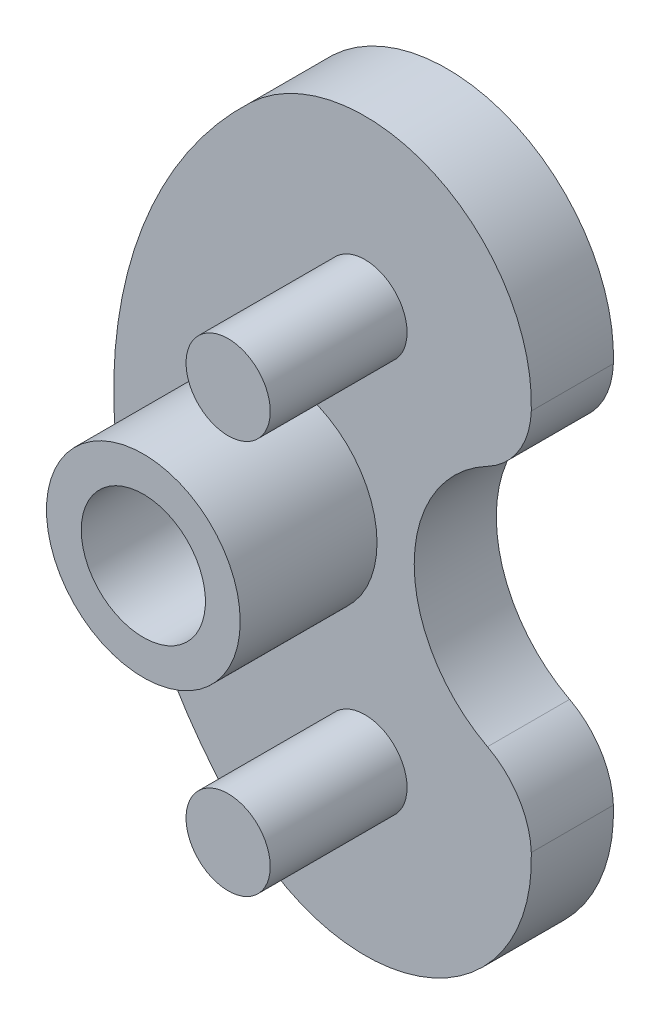
ISO-10303-21;
HEADER;
FILE_DESCRIPTION(('STEP AP214'),'2;1');
FILE_NAME('part.step','',(''),(''),'','','');
FILE_SCHEMA(('AUTOMOTIVE_DESIGN { 1 0 10303 214 1 1 1 1 }'));
ENDSEC;
DATA;
#1=APPLICATION_CONTEXT('core data for automotive mechanical design processes');
#2=APPLICATION_PROTOCOL_DEFINITION('international standard','automotive_design',2000,#1);
#3=PRODUCT_CONTEXT('',#1,'mechanical');
#4=PRODUCT('Part','Part','',(#3));
#5=PRODUCT_RELATED_PRODUCT_CATEGORY('part','',(#4));
#6=PRODUCT_DEFINITION_FORMATION('','',#4);
#7=PRODUCT_DEFINITION_CONTEXT('part definition',#1,'design');
#8=PRODUCT_DEFINITION('design','',#6,#7);
#9=PRODUCT_DEFINITION_SHAPE('','',#8);
#10=(LENGTH_UNIT() NAMED_UNIT(*) SI_UNIT(.MILLI.,.METRE.));
#11=(NAMED_UNIT(*) PLANE_ANGLE_UNIT() SI_UNIT($,.RADIAN.));
#12=(NAMED_UNIT(*) SI_UNIT($,.STERADIAN.) SOLID_ANGLE_UNIT());
#13=UNCERTAINTY_MEASURE_WITH_UNIT(LENGTH_MEASURE(1.E-05),#10,'distance_accuracy_value','');
#14=(GEOMETRIC_REPRESENTATION_CONTEXT(3) GLOBAL_UNCERTAINTY_ASSIGNED_CONTEXT((#13)) GLOBAL_UNIT_ASSIGNED_CONTEXT((#10,
#11,#12)) REPRESENTATION_CONTEXT('',''));
#15=CARTESIAN_POINT('',(0.,0.,0.));
#16=DIRECTION('',(0.,0.,1.));
#17=DIRECTION('',(1.,0.,0.));
#18=AXIS2_PLACEMENT_3D('',#15,#16,#17);
#19=CARTESIAN_POINT('',(-14.5880115884789,0.,-13.745));
#20=DIRECTION('',(0.,0.,-1.));
#21=DIRECTION('',(-1.,0.,0.));
#22=AXIS2_PLACEMENT_3D('',#19,#20,#21);
#23=PLANE('',#22);
#24=CARTESIAN_POINT('',(-6.81696153884559,7.20201829964587,-13.745));
#25=DIRECTION('',(0.,0.,1.));
#26=DIRECTION('',(1.,0.,0.));
#27=AXIS2_PLACEMENT_3D('',#24,#25,#26);
#28=CIRCLE('',#27,1.53885172207011);
#29=CARTESIAN_POINT('',(-5.27810981677548,7.20201829964587,-13.745));
#30=VERTEX_POINT('',#29);
#31=EDGE_CURVE('E154',#30,#30,#28,.F.);
#32=ORIENTED_EDGE('',*,*,#31,.F.);
#33=EDGE_LOOP('',(#32));
#34=FACE_BOUND('',#33,.T.);
#35=ADVANCED_FACE('F32',(#34),#23,.F.);
#36=CARTESIAN_POINT('',(-6.81696153884559,-7.20201829964587,-13.745));
#37=DIRECTION('',(0.,0.,1.));
#38=DIRECTION('',(1.,0.,0.));
#39=AXIS2_PLACEMENT_3D('',#36,#37,#38);
#40=CIRCLE('',#39,1.53885172207011);
#41=CARTESIAN_POINT('',(-5.27810981677548,-7.20201829964587,-13.745));
#42=VERTEX_POINT('',#41);
#43=EDGE_CURVE('E157',#42,#42,#40,.F.);
#44=ORIENTED_EDGE('',*,*,#43,.F.);
#45=EDGE_LOOP('',(#44));
#46=FACE_BOUND('',#45,.T.);
#47=ADVANCED_FACE('F181',(#46),#23,.F.);
#48=CARTESIAN_POINT('',(-9.91665428511723,0.,-13.745));
#49=DIRECTION('',(0.,0.,-1.));
#50=DIRECTION('',(-1.,0.,0.));
#51=AXIS2_PLACEMENT_3D('',#48,#49,#50);
#52=CIRCLE('',#51,2.26880471802471);
#53=CARTESIAN_POINT('',(-12.1854590031419,0.,-13.745));
#54=VERTEX_POINT('',#53);
#55=EDGE_CURVE('E11',#54,#54,#52,.F.);
#56=ORIENTED_EDGE('',*,*,#55,.F.);
#57=EDGE_LOOP('',(#56));
#58=FACE_BOUND('',#57,.T.);
#59=CARTESIAN_POINT('',(-9.91665428511723,0.,-13.745));
#60=DIRECTION('',(0.,0.,1.));
#61=DIRECTION('',(1.,0.,0.));
#62=AXIS2_PLACEMENT_3D('',#59,#60,#61);
#63=CIRCLE('',#62,3.54083599682753);
#64=CARTESIAN_POINT('',(-6.3758182882897,0.,-13.745));
#65=VERTEX_POINT('',#64);
#66=EDGE_CURVE('E151',#65,#65,#63,.F.);
#67=ORIENTED_EDGE('',*,*,#66,.F.);
#68=EDGE_LOOP('',(#67));
#69=FACE_BOUND('',#68,.T.);
#70=ADVANCED_FACE('F183',(#58,#69),#23,.F.);
#71=CARTESIAN_POINT('',(-3.73554540133623,-7.09295233344732,-18.745));
#72=DIRECTION('',(0.,0.,-1.));
#73=DIRECTION('',(-1.,0.,0.));
#74=AXIS2_PLACEMENT_3D('',#71,#72,#73);
#75=CYLINDRICAL_SURFACE('',#74,3.);
#76=CARTESIAN_POINT('',(-3.73554540133623,-7.09295233344732,-21.745));
#77=DIRECTION('',(0.,0.,-1.));
#78=DIRECTION('',(1.,0.,0.));
#79=AXIS2_PLACEMENT_3D('',#76,#77,#78);
#80=CIRCLE('',#79,3.);
#81=CARTESIAN_POINT('',(-2.33759913999915,-4.43856987223083,-21.745));
#82=VERTEX_POINT('',#81);
#83=CARTESIAN_POINT('',(-0.737422820430779,-6.98683452219563,-21.745));
#84=VERTEX_POINT('',#83);
#85=EDGE_CURVE('E132',#82,#84,#80,.T.);
#86=ORIENTED_EDGE('',*,*,#85,.F.);
#87=DIRECTION('',(0.,0.,-1.));
#88=VECTOR('',#87,1.);
#89=CARTESIAN_POINT('',(-2.33759913999915,-4.43856987223083,-18.745));
#90=LINE('',#89,#88);
#91=CARTESIAN_POINT('',(-2.33759913999915,-4.43856987223083,-18.745));
#92=VERTEX_POINT('',#91);
#93=EDGE_CURVE('E71',#92,#82,#90,.T.);
#94=ORIENTED_EDGE('',*,*,#93,.F.);
#95=CARTESIAN_POINT('',(-3.73554540133623,-7.09295233344732,-18.745));
#96=DIRECTION('',(0.,0.,-1.));
#97=DIRECTION('',(1.,0.,0.));
#98=AXIS2_PLACEMENT_3D('',#95,#96,#97);
#99=CIRCLE('',#98,3.);
#100=CARTESIAN_POINT('',(-0.737422820430779,-6.98683452219563,-18.745));
#101=VERTEX_POINT('',#100);
#102=EDGE_CURVE('E110',#92,#101,#99,.T.);
#103=ORIENTED_EDGE('',*,*,#102,.T.);
#104=DIRECTION('',(0.,0.,-1.));
#105=VECTOR('',#104,1.);
#106=CARTESIAN_POINT('',(-0.737422820430779,-6.98683452219563,-18.745));
#107=LINE('',#106,#105);
#108=EDGE_CURVE('E48',#101,#84,#107,.T.);
#109=ORIENTED_EDGE('',*,*,#108,.T.);
#110=EDGE_LOOP('',(#86,#94,#103,#109));
#111=FACE_BOUND('',#110,.T.);
#112=ADVANCED_FACE('F190',(#111),#75,.T.);
#113=CARTESIAN_POINT('',(0.,0.,-18.745));
#114=DIRECTION('',(0.,0.,-1.));
#115=DIRECTION('',(-1.,0.,0.));
#116=AXIS2_PLACEMENT_3D('',#113,#114,#115);
#117=CYLINDRICAL_SURFACE('',#116,5.0165);
#118=CARTESIAN_POINT('',(0.,0.,-21.745));
#119=DIRECTION('',(0.,0.,1.));
#120=DIRECTION('',(-1.,0.,0.));
#121=AXIS2_PLACEMENT_3D('',#118,#119,#120);
#122=CIRCLE('',#121,5.0165);
#123=CARTESIAN_POINT('',(-2.33759913999915,4.43856987223084,-21.745));
#124=VERTEX_POINT('',#123);
#125=EDGE_CURVE('E96',#124,#82,#122,.T.);
#126=ORIENTED_EDGE('',*,*,#125,.F.);
#127=DIRECTION('',(0.,0.,-1.));
#128=VECTOR('',#127,1.);
#129=CARTESIAN_POINT('',(-2.33759913999915,4.43856987223084,-18.745));
#130=LINE('',#129,#128);
#131=CARTESIAN_POINT('',(-2.33759913999915,4.43856987223084,-18.745));
#132=VERTEX_POINT('',#131);
#133=EDGE_CURVE('E91',#132,#124,#130,.T.);
#134=ORIENTED_EDGE('',*,*,#133,.F.);
#135=CARTESIAN_POINT('',(0.,0.,-18.745));
#136=DIRECTION('',(0.,0.,1.));
#137=DIRECTION('',(-1.,0.,0.));
#138=AXIS2_PLACEMENT_3D('',#135,#136,#137);
#139=CIRCLE('',#138,5.0165);
#140=EDGE_CURVE('E94',#132,#92,#139,.T.);
#141=ORIENTED_EDGE('',*,*,#140,.T.);
#142=ORIENTED_EDGE('',*,*,#93,.T.);
#143=EDGE_LOOP('',(#126,#134,#141,#142));
#144=FACE_BOUND('',#143,.T.);
#145=ADVANCED_FACE('F93',(#144),#117,.F.);
#146=CARTESIAN_POINT('',(-3.73554540133623,7.09295233344732,-18.745));
#147=DIRECTION('',(0.,0.,-1.));
#148=DIRECTION('',(-1.,0.,0.));
#149=AXIS2_PLACEMENT_3D('',#146,#147,#148);
#150=CYLINDRICAL_SURFACE('',#149,3.);
#151=CARTESIAN_POINT('',(-3.73554540133623,7.09295233344732,-21.745));
#152=DIRECTION('',(0.,0.,-1.));
#153=DIRECTION('',(-1.,0.,0.));
#154=AXIS2_PLACEMENT_3D('',#151,#152,#153);
#155=CIRCLE('',#154,3.);
#156=CARTESIAN_POINT('',(-0.737422820430777,6.98683452219563,-21.745));
#157=VERTEX_POINT('',#156);
#158=EDGE_CURVE('E129',#157,#124,#155,.T.);
#159=ORIENTED_EDGE('',*,*,#158,.F.);
#160=DIRECTION('',(0.,0.,-1.));
#161=VECTOR('',#160,1.);
#162=CARTESIAN_POINT('',(-0.737422820430777,6.98683452219563,-18.745));
#163=LINE('',#162,#161);
#164=CARTESIAN_POINT('',(-0.737422820430777,6.98683452219563,-18.745));
#165=VERTEX_POINT('',#164);
#166=EDGE_CURVE('E101',#165,#157,#163,.T.);
#167=ORIENTED_EDGE('',*,*,#166,.F.);
#168=CARTESIAN_POINT('',(-3.73554540133623,7.09295233344732,-18.745));
#169=DIRECTION('',(0.,0.,-1.));
#170=DIRECTION('',(-1.,0.,0.));
#171=AXIS2_PLACEMENT_3D('',#168,#169,#170);
#172=CIRCLE('',#171,3.);
#173=EDGE_CURVE('E108',#165,#132,#172,.T.);
#174=ORIENTED_EDGE('',*,*,#173,.T.);
#175=ORIENTED_EDGE('',*,*,#133,.T.);
#176=EDGE_LOOP('',(#159,#167,#174,#175));
#177=FACE_BOUND('',#176,.T.);
#178=ADVANCED_FACE('F112',(#177),#150,.T.);
#179=CARTESIAN_POINT('',(-6.81696153884559,7.20201829964587,-18.745));
#180=DIRECTION('',(0.,0.,-1.));
#181=DIRECTION('',(-1.,0.,0.));
#182=AXIS2_PLACEMENT_3D('',#179,#180,#181);
#183=CYLINDRICAL_SURFACE('',#182,6.08334571488277);
#184=CARTESIAN_POINT('',(-6.81696153884559,7.20201829964587,-21.745));
#185=DIRECTION('',(0.,0.,-1.));
#186=DIRECTION('',(1.,0.,0.));
#187=AXIS2_PLACEMENT_3D('',#184,#185,#186);
#188=CIRCLE('',#187,6.08334571488277);
#189=CARTESIAN_POINT('',(-10.9988088205537,11.620077647284,-21.745));
#190=VERTEX_POINT('',#189);
#191=EDGE_CURVE('E126',#190,#157,#188,.T.);
#192=ORIENTED_EDGE('',*,*,#191,.F.);
#193=DIRECTION('',(0.,0.,-1.));
#194=VECTOR('',#193,1.);
#195=CARTESIAN_POINT('',(-10.9988088205537,11.620077647284,-18.745));
#196=LINE('',#195,#194);
#197=CARTESIAN_POINT('',(-10.9988088205537,11.620077647284,-18.745));
#198=VERTEX_POINT('',#197);
#199=EDGE_CURVE('E140',#198,#190,#196,.T.);
#200=ORIENTED_EDGE('',*,*,#199,.F.);
#201=CARTESIAN_POINT('',(-6.81696153884559,7.20201829964587,-18.745));
#202=DIRECTION('',(0.,0.,-1.));
#203=DIRECTION('',(1.,0.,0.));
#204=AXIS2_PLACEMENT_3D('',#201,#202,#203);
#205=CIRCLE('',#204,6.08334571488277);
#206=EDGE_CURVE('E113',#198,#165,#205,.T.);
#207=ORIENTED_EDGE('',*,*,#206,.T.);
#208=ORIENTED_EDGE('',*,*,#166,.T.);
#209=EDGE_LOOP('',(#192,#200,#207,#208));
#210=FACE_BOUND('',#209,.T.);
#211=ADVANCED_FACE('F218',(#210),#183,.T.);
#212=CARTESIAN_POINT('',(0.,0.,-18.745));
#213=DIRECTION('',(0.,0.,-1.));
#214=DIRECTION('',(-1.,0.,0.));
#215=AXIS2_PLACEMENT_3D('',#212,#213,#214);
#216=CYLINDRICAL_SURFACE('',#215,16.);
#217=CARTESIAN_POINT('',(0.,0.,-21.745));
#218=DIRECTION('',(0.,0.,-1.));
#219=DIRECTION('',(-1.,0.,0.));
#220=AXIS2_PLACEMENT_3D('',#217,#218,#219);
#221=CIRCLE('',#220,16.);
#222=CARTESIAN_POINT('',(-10.9988088205537,-11.620077647284,-21.745));
#223=VERTEX_POINT('',#222);
#224=EDGE_CURVE('E123',#223,#190,#221,.T.);
#225=ORIENTED_EDGE('',*,*,#224,.F.);
#226=DIRECTION('',(0.,0.,-1.));
#227=VECTOR('',#226,1.);
#228=CARTESIAN_POINT('',(-10.9988088205537,-11.620077647284,-18.745));
#229=LINE('',#228,#227);
#230=CARTESIAN_POINT('',(-10.9988088205537,-11.620077647284,-18.745));
#231=VERTEX_POINT('',#230);
#232=EDGE_CURVE('E83',#231,#223,#229,.T.);
#233=ORIENTED_EDGE('',*,*,#232,.F.);
#234=CARTESIAN_POINT('',(0.,0.,-18.745));
#235=DIRECTION('',(0.,0.,-1.));
#236=DIRECTION('',(-1.,0.,0.));
#237=AXIS2_PLACEMENT_3D('',#234,#235,#236);
#238=CIRCLE('',#237,16.);
#239=EDGE_CURVE('E115',#231,#198,#238,.T.);
#240=ORIENTED_EDGE('',*,*,#239,.T.);
#241=ORIENTED_EDGE('',*,*,#199,.T.);
#242=EDGE_LOOP('',(#225,#233,#240,#241));
#243=FACE_BOUND('',#242,.T.);
#244=ADVANCED_FACE('F215',(#243),#216,.T.);
#245=CARTESIAN_POINT('',(-6.81696153884559,-7.20201829964587,-18.745));
#246=DIRECTION('',(0.,0.,-1.));
#247=DIRECTION('',(-1.,0.,0.));
#248=AXIS2_PLACEMENT_3D('',#245,#246,#247);
#249=CYLINDRICAL_SURFACE('',#248,6.08334571488277);
#250=CARTESIAN_POINT('',(-6.81696153884559,-7.20201829964587,-21.745));
#251=DIRECTION('',(0.,0.,-1.));
#252=DIRECTION('',(-1.,0.,0.));
#253=AXIS2_PLACEMENT_3D('',#250,#251,#252);
#254=CIRCLE('',#253,6.08334571488277);
#255=EDGE_CURVE('E120',#84,#223,#254,.T.);
#256=ORIENTED_EDGE('',*,*,#255,.F.);
#257=ORIENTED_EDGE('',*,*,#108,.F.);
#258=CARTESIAN_POINT('',(-6.81696153884559,-7.20201829964587,-18.745));
#259=DIRECTION('',(0.,0.,-1.));
#260=DIRECTION('',(-1.,0.,0.));
#261=AXIS2_PLACEMENT_3D('',#258,#259,#260);
#262=CIRCLE('',#261,6.08334571488277);
#263=EDGE_CURVE('E135',#101,#231,#262,.T.);
#264=ORIENTED_EDGE('',*,*,#263,.T.);
#265=ORIENTED_EDGE('',*,*,#232,.T.);
#266=EDGE_LOOP('',(#256,#257,#264,#265));
#267=FACE_BOUND('',#266,.T.);
#268=ADVANCED_FACE('F206',(#267),#249,.T.);
#269=CARTESIAN_POINT('',(-9.91665428511723,0.,-21.745));
#270=DIRECTION('',(0.,0.,-1.));
#271=DIRECTION('',(-1.,0.,0.));
#272=AXIS2_PLACEMENT_3D('',#269,#270,#271);
#273=PLANE('',#272);
#274=CARTESIAN_POINT('',(-9.91665428511723,0.,-21.745));
#275=DIRECTION('',(0.,0.,-1.));
#276=DIRECTION('',(-1.,0.,0.));
#277=AXIS2_PLACEMENT_3D('',#274,#275,#276);
#278=CIRCLE('',#277,2.26880471802471);
#279=CARTESIAN_POINT('',(-12.1854590031419,0.,-21.745));
#280=VERTEX_POINT('',#279);
#281=EDGE_CURVE('E137',#280,#280,#278,.T.);
#282=ORIENTED_EDGE('',*,*,#281,.F.);
#283=EDGE_LOOP('',(#282));
#284=FACE_BOUND('',#283,.T.);
#285=ORIENTED_EDGE('',*,*,#255,.T.);
#286=ORIENTED_EDGE('',*,*,#224,.T.);
#287=ORIENTED_EDGE('',*,*,#191,.T.);
#288=ORIENTED_EDGE('',*,*,#158,.T.);
#289=ORIENTED_EDGE('',*,*,#125,.T.);
#290=ORIENTED_EDGE('',*,*,#85,.T.);
#291=EDGE_LOOP('',(#285,#286,#287,#288,#289,#290));
#292=FACE_BOUND('',#291,.T.);
#293=ADVANCED_FACE('F204',(#284,#292),#273,.T.);
#294=CARTESIAN_POINT('',(-9.91665428511723,0.,0.999999999999997));
#295=DIRECTION('',(0.,0.,-1.));
#296=DIRECTION('',(-1.,0.,0.));
#297=AXIS2_PLACEMENT_3D('',#294,#295,#296);
#298=CYLINDRICAL_SURFACE('',#297,2.26880471802471);
#299=ORIENTED_EDGE('',*,*,#55,.T.);
#300=EDGE_LOOP('',(#299));
#301=FACE_BOUND('',#300,.T.);
#302=ORIENTED_EDGE('',*,*,#281,.T.);
#303=EDGE_LOOP('',(#302));
#304=FACE_BOUND('',#303,.T.);
#305=ADVANCED_FACE('F175',(#301,#304),#298,.F.);
#306=CARTESIAN_POINT('',(-3.40848076942279,-3.60100914982293,-18.745));
#307=DIRECTION('',(0.,0.,-1.));
#308=DIRECTION('',(-1.,0.,0.));
#309=AXIS2_PLACEMENT_3D('',#306,#307,#308);
#310=PLANE('',#309);
#311=CARTESIAN_POINT('',(-6.81696153884559,7.20201829964587,-18.745));
#312=DIRECTION('',(0.,0.,-1.));
#313=DIRECTION('',(-1.,0.,0.));
#314=AXIS2_PLACEMENT_3D('',#311,#312,#313);
#315=CIRCLE('',#314,1.53885172207011);
#316=CARTESIAN_POINT('',(-8.3558132609157,7.20201829964587,-18.745));
#317=VERTEX_POINT('',#316);
#318=EDGE_CURVE('E143',#317,#317,#315,.T.);
#319=ORIENTED_EDGE('',*,*,#318,.T.);
#320=EDGE_LOOP('',(#319));
#321=FACE_BOUND('',#320,.T.);
#322=ORIENTED_EDGE('',*,*,#263,.F.);
#323=ORIENTED_EDGE('',*,*,#102,.F.);
#324=ORIENTED_EDGE('',*,*,#140,.F.);
#325=ORIENTED_EDGE('',*,*,#173,.F.);
#326=ORIENTED_EDGE('',*,*,#206,.F.);
#327=ORIENTED_EDGE('',*,*,#239,.F.);
#328=EDGE_LOOP('',(#322,#323,#324,#325,#326,#327));
#329=FACE_BOUND('',#328,.T.);
#330=CARTESIAN_POINT('',(-6.81696153884559,-7.20201829964587,-18.745));
#331=DIRECTION('',(0.,0.,-1.));
#332=DIRECTION('',(-1.,0.,0.));
#333=AXIS2_PLACEMENT_3D('',#330,#331,#332);
#334=CIRCLE('',#333,1.53885172207011);
#335=CARTESIAN_POINT('',(-8.3558132609157,-7.20201829964587,-18.745));
#336=VERTEX_POINT('',#335);
#337=EDGE_CURVE('E146',#336,#336,#334,.T.);
#338=ORIENTED_EDGE('',*,*,#337,.T.);
#339=EDGE_LOOP('',(#338));
#340=FACE_BOUND('',#339,.T.);
#341=CARTESIAN_POINT('',(-9.91665428511723,0.,-18.745));
#342=DIRECTION('',(0.,0.,-1.));
#343=DIRECTION('',(-1.,0.,0.));
#344=AXIS2_PLACEMENT_3D('',#341,#342,#343);
#345=CIRCLE('',#344,3.54083599682753);
#346=CARTESIAN_POINT('',(-13.4574902819448,0.,-18.745));
#347=VERTEX_POINT('',#346);
#348=EDGE_CURVE('E40',#347,#347,#345,.T.);
#349=ORIENTED_EDGE('',*,*,#348,.T.);
#350=EDGE_LOOP('',(#349));
#351=FACE_BOUND('',#350,.T.);
#352=ADVANCED_FACE('F105',(#321,#329,#340,#351),#310,.F.);
#353=CARTESIAN_POINT('',(-6.81696153884559,-7.20201829964587,-21.745));
#354=DIRECTION('',(0.,0.,1.));
#355=DIRECTION('',(1.,0.,0.));
#356=AXIS2_PLACEMENT_3D('',#353,#354,#355);
#357=CYLINDRICAL_SURFACE('',#356,1.53885172207011);
#358=ORIENTED_EDGE('',*,*,#43,.T.);
#359=EDGE_LOOP('',(#358));
#360=FACE_BOUND('',#359,.T.);
#361=ORIENTED_EDGE('',*,*,#337,.F.);
#362=EDGE_LOOP('',(#361));
#363=FACE_BOUND('',#362,.T.);
#364=ADVANCED_FACE('F163',(#360,#363),#357,.T.);
#365=CARTESIAN_POINT('',(-9.91665428511723,0.,-21.745));
#366=DIRECTION('',(0.,0.,1.));
#367=DIRECTION('',(1.,0.,0.));
#368=AXIS2_PLACEMENT_3D('',#365,#366,#367);
#369=CYLINDRICAL_SURFACE('',#368,3.54083599682753);
#370=ORIENTED_EDGE('',*,*,#66,.T.);
#371=EDGE_LOOP('',(#370));
#372=FACE_BOUND('',#371,.T.);
#373=ORIENTED_EDGE('',*,*,#348,.F.);
#374=EDGE_LOOP('',(#373));
#375=FACE_BOUND('',#374,.T.);
#376=ADVANCED_FACE('F165',(#372,#375),#369,.T.);
#377=CARTESIAN_POINT('',(-6.81696153884559,7.20201829964587,-21.745));
#378=DIRECTION('',(0.,0.,1.));
#379=DIRECTION('',(1.,0.,0.));
#380=AXIS2_PLACEMENT_3D('',#377,#378,#379);
#381=CYLINDRICAL_SURFACE('',#380,1.53885172207011);
#382=ORIENTED_EDGE('',*,*,#31,.T.);
#383=EDGE_LOOP('',(#382));
#384=FACE_BOUND('',#383,.T.);
#385=ORIENTED_EDGE('',*,*,#318,.F.);
#386=EDGE_LOOP('',(#385));
#387=FACE_BOUND('',#386,.T.);
#388=ADVANCED_FACE('F172',(#384,#387),#381,.T.);
#389=CLOSED_SHELL('',(#35,#47,#70,#112,#145,#178,#211,#244,#268,#293,#305,#352,#364,#376,#388));
#390=MANIFOLD_SOLID_BREP('B2',#389);
#391=ADVANCED_BREP_SHAPE_REPRESENTATION('',(#18,#390),#14);
#392=SHAPE_DEFINITION_REPRESENTATION(#9,#391);
ENDSEC;
END-ISO-10303-21;
